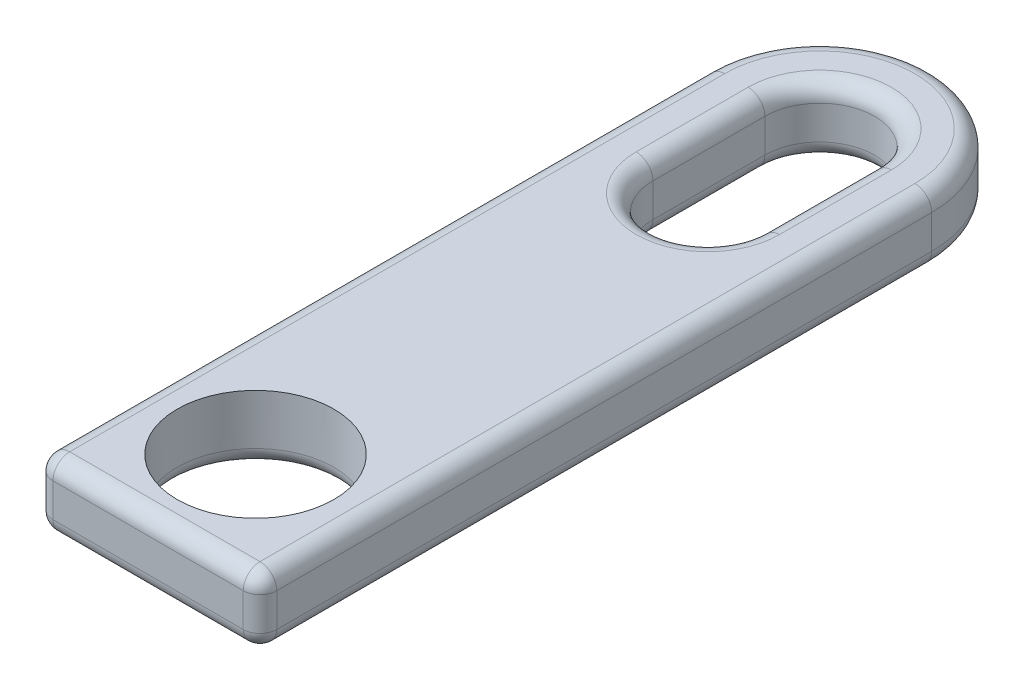
ISO-10303-21;
HEADER;
FILE_DESCRIPTION(('STEP AP214'),'2;1');
FILE_NAME('part.step','',(''),(''),'','','');
FILE_SCHEMA(('AUTOMOTIVE_DESIGN { 1 0 10303 214 1 1 1 1 }'));
ENDSEC;
DATA;
#1=APPLICATION_CONTEXT('core data for automotive mechanical design processes');
#2=APPLICATION_PROTOCOL_DEFINITION('international standard','automotive_design',2000,#1);
#3=PRODUCT_CONTEXT('',#1,'mechanical');
#4=PRODUCT('Part','Part','',(#3));
#5=PRODUCT_RELATED_PRODUCT_CATEGORY('part','',(#4));
#6=PRODUCT_DEFINITION_FORMATION('','',#4);
#7=PRODUCT_DEFINITION_CONTEXT('part definition',#1,'design');
#8=PRODUCT_DEFINITION('design','',#6,#7);
#9=PRODUCT_DEFINITION_SHAPE('','',#8);
#10=(LENGTH_UNIT() NAMED_UNIT(*) SI_UNIT(.MILLI.,.METRE.));
#11=(NAMED_UNIT(*) PLANE_ANGLE_UNIT() SI_UNIT($,.RADIAN.));
#12=(NAMED_UNIT(*) SI_UNIT($,.STERADIAN.) SOLID_ANGLE_UNIT());
#13=UNCERTAINTY_MEASURE_WITH_UNIT(LENGTH_MEASURE(1.E-05),#10,'distance_accuracy_value','');
#14=(GEOMETRIC_REPRESENTATION_CONTEXT(3) GLOBAL_UNCERTAINTY_ASSIGNED_CONTEXT((#13)) GLOBAL_UNIT_ASSIGNED_CONTEXT((#10,
#11,#12)) REPRESENTATION_CONTEXT('',''));
#15=CARTESIAN_POINT('',(0.,0.,0.));
#16=DIRECTION('',(0.,0.,1.));
#17=DIRECTION('',(1.,0.,0.));
#18=AXIS2_PLACEMENT_3D('',#15,#16,#17);
#19=CARTESIAN_POINT('',(0.,0.,7.44915748014848));
#20=DIRECTION('',(0.,-1.,0.));
#21=DIRECTION('',(0.,0.,-1.));
#22=AXIS2_PLACEMENT_3D('',#19,#20,#21);
#23=PLANE('',#22);
#24=DIRECTION('',(1.,0.,0.));
#25=VECTOR('',#24,1.);
#26=CARTESIAN_POINT('',(-5.,0.,36.6991574801485));
#27=LINE('',#26,#25);
#28=CARTESIAN_POINT('',(4.25,0.,36.6991574801485));
#29=VERTEX_POINT('',#28);
#30=CARTESIAN_POINT('',(1.28840987267252,0.,36.6991574801485));
#31=VERTEX_POINT('',#30);
#32=EDGE_CURVE('E56',#29,#31,#27,.F.);
#33=ORIENTED_EDGE('',*,*,#32,.T.);
#34=CARTESIAN_POINT('',(0.,0.,32.6491574801485));
#35=DIRECTION('',(0.,-1.,0.));
#36=DIRECTION('',(0.,0.,-1.));
#37=AXIS2_PLACEMENT_3D('',#34,#35,#36);
#38=CIRCLE('',#37,4.25);
#39=CARTESIAN_POINT('',(4.25,0.,32.6491574801485));
#40=VERTEX_POINT('',#39);
#41=EDGE_CURVE('E291',#31,#40,#38,.F.);
#42=ORIENTED_EDGE('',*,*,#41,.T.);
#43=DIRECTION('',(0.,0.,-1.));
#44=VECTOR('',#43,1.);
#45=CARTESIAN_POINT('',(4.25,0.,37.4491574801485));
#46=LINE('',#45,#44);
#47=EDGE_CURVE('E60',#40,#29,#46,.F.);
#48=ORIENTED_EDGE('',*,*,#47,.T.);
#49=EDGE_LOOP('',(#33,#42,#48));
#50=FACE_BOUND('',#49,.T.);
#51=ADVANCED_FACE('F39',(#50),#23,.T.);
#52=DIRECTION('',(0.,0.,1.));
#53=VECTOR('',#52,1.);
#54=CARTESIAN_POINT('',(-4.25,0.,7.44915748014848));
#55=LINE('',#54,#53);
#56=CARTESIAN_POINT('',(-4.25,0.,36.6991574801485));
#57=VERTEX_POINT('',#56);
#58=CARTESIAN_POINT('',(-4.25,0.,32.6491574801485));
#59=VERTEX_POINT('',#58);
#60=EDGE_CURVE('E271',#57,#59,#55,.F.);
#61=ORIENTED_EDGE('',*,*,#60,.T.);
#62=CARTESIAN_POINT('',(0.,0.,32.6491574801485));
#63=DIRECTION('',(0.,-1.,0.));
#64=DIRECTION('',(0.,0.,-1.));
#65=AXIS2_PLACEMENT_3D('',#62,#63,#64);
#66=CIRCLE('',#65,4.25);
#67=CARTESIAN_POINT('',(-1.28840987267252,0.,36.6991574801485));
#68=VERTEX_POINT('',#67);
#69=EDGE_CURVE('E278',#59,#68,#66,.F.);
#70=ORIENTED_EDGE('',*,*,#69,.T.);
#71=DIRECTION('',(1.,0.,0.));
#72=VECTOR('',#71,1.);
#73=CARTESIAN_POINT('',(-5.,0.,36.6991574801485));
#74=LINE('',#73,#72);
#75=EDGE_CURVE('E276',#68,#57,#74,.F.);
#76=ORIENTED_EDGE('',*,*,#75,.T.);
#77=EDGE_LOOP('',(#61,#70,#76));
#78=FACE_BOUND('',#77,.T.);
#79=ADVANCED_FACE('F394',(#78),#23,.T.);
#80=CARTESIAN_POINT('',(0.,3.,7.44915748014848));
#81=DIRECTION('',(0.,-1.,0.));
#82=DIRECTION('',(0.,0.,-1.));
#83=AXIS2_PLACEMENT_3D('',#80,#81,#82);
#84=PLANE('',#83);
#85=DIRECTION('',(0.,0.,1.));
#86=VECTOR('',#85,1.);
#87=CARTESIAN_POINT('',(-4.25,3.,7.44915748014848));
#88=LINE('',#87,#86);
#89=CARTESIAN_POINT('',(-4.25,3.,7.44915748014848));
#90=VERTEX_POINT('',#89);
#91=CARTESIAN_POINT('',(-4.25,3.,36.6991574801485));
#92=VERTEX_POINT('',#91);
#93=EDGE_CURVE('E232',#90,#92,#88,.T.);
#94=ORIENTED_EDGE('',*,*,#93,.T.);
#95=DIRECTION('',(1.,0.,0.));
#96=VECTOR('',#95,1.);
#97=CARTESIAN_POINT('',(0.,3.,36.6991574801485));
#98=LINE('',#97,#96);
#99=CARTESIAN_POINT('',(4.25,3.,36.6991574801485));
#100=VERTEX_POINT('',#99);
#101=EDGE_CURVE('E235',#92,#100,#98,.T.);
#102=ORIENTED_EDGE('',*,*,#101,.T.);
#103=DIRECTION('',(0.,0.,-1.));
#104=VECTOR('',#103,1.);
#105=CARTESIAN_POINT('',(4.25,3.,7.44915748014848));
#106=LINE('',#105,#104);
#107=CARTESIAN_POINT('',(4.25,3.,7.44915748014848));
#108=VERTEX_POINT('',#107);
#109=EDGE_CURVE('E230',#100,#108,#106,.T.);
#110=ORIENTED_EDGE('',*,*,#109,.T.);
#111=CARTESIAN_POINT('',(0.,3.,7.44915748014848));
#112=DIRECTION('',(0.,-1.,0.));
#113=DIRECTION('',(0.,0.,-1.));
#114=AXIS2_PLACEMENT_3D('',#111,#112,#113);
#115=CIRCLE('',#114,4.25);
#116=EDGE_CURVE('E228',#108,#90,#115,.F.);
#117=ORIENTED_EDGE('',*,*,#116,.T.);
#118=EDGE_LOOP('',(#94,#102,#110,#117));
#119=FACE_BOUND('',#118,.T.);
#120=DIRECTION('',(0.,0.,1.));
#121=VECTOR('',#120,1.);
#122=CARTESIAN_POINT('',(-3.20000000000001,3.,7.44915748014848));
#123=LINE('',#122,#121);
#124=CARTESIAN_POINT('',(-3.2,3.,12.4491574801485));
#125=VERTEX_POINT('',#124);
#126=CARTESIAN_POINT('',(-3.20000000000001,3.,7.44915748014848));
#127=VERTEX_POINT('',#126);
#128=EDGE_CURVE('E216',#125,#127,#123,.F.);
#129=ORIENTED_EDGE('',*,*,#128,.T.);
#130=CARTESIAN_POINT('',(0.,3.,7.44915748014848));
#131=DIRECTION('',(0.,-1.,0.));
#132=DIRECTION('',(0.,0.,-1.));
#133=AXIS2_PLACEMENT_3D('',#130,#131,#132);
#134=CIRCLE('',#133,3.2);
#135=CARTESIAN_POINT('',(3.2,3.,7.44915748014848));
#136=VERTEX_POINT('',#135);
#137=EDGE_CURVE('E226',#127,#136,#134,.T.);
#138=ORIENTED_EDGE('',*,*,#137,.T.);
#139=DIRECTION('',(0.,0.,-1.));
#140=VECTOR('',#139,1.);
#141=CARTESIAN_POINT('',(3.2,3.,12.4491574801485));
#142=LINE('',#141,#140);
#143=CARTESIAN_POINT('',(3.2,3.,12.4491574801485));
#144=VERTEX_POINT('',#143);
#145=EDGE_CURVE('E206',#136,#144,#142,.F.);
#146=ORIENTED_EDGE('',*,*,#145,.T.);
#147=CARTESIAN_POINT('',(0.,3.,12.4491574801485));
#148=DIRECTION('',(0.,-1.,0.));
#149=DIRECTION('',(0.,0.,-1.));
#150=AXIS2_PLACEMENT_3D('',#147,#148,#149);
#151=CIRCLE('',#150,3.2);
#152=EDGE_CURVE('E218',#144,#125,#151,.T.);
#153=ORIENTED_EDGE('',*,*,#152,.T.);
#154=EDGE_LOOP('',(#129,#138,#146,#153));
#155=FACE_BOUND('',#154,.T.);
#156=CARTESIAN_POINT('',(0.,3.,32.6491574801485));
#157=DIRECTION('',(0.,1.,0.));
#158=DIRECTION('',(0.,0.,1.));
#159=AXIS2_PLACEMENT_3D('',#156,#157,#158);
#160=CIRCLE('',#159,3.5);
#161=CARTESIAN_POINT('',(0.,3.,36.1491574801485));
#162=VERTEX_POINT('',#161);
#163=EDGE_CURVE('E201',#162,#162,#160,.T.);
#164=ORIENTED_EDGE('',*,*,#163,.F.);
#165=EDGE_LOOP('',(#164));
#166=FACE_BOUND('',#165,.T.);
#167=ADVANCED_FACE('F400',(#119,#155,#166),#84,.F.);
#168=DIRECTION('',(0.,0.,1.));
#169=VECTOR('',#168,1.);
#170=CARTESIAN_POINT('',(-3.20000000000001,0.,7.44915748014848));
#171=LINE('',#170,#169);
#172=CARTESIAN_POINT('',(-3.2,0.,7.44915748014848));
#173=VERTEX_POINT('',#172);
#174=CARTESIAN_POINT('',(-3.2,0.,12.4491574801485));
#175=VERTEX_POINT('',#174);
#176=EDGE_CURVE('E284',#173,#175,#171,.T.);
#177=ORIENTED_EDGE('',*,*,#176,.T.);
#178=CARTESIAN_POINT('',(0.,0.,12.4491574801485));
#179=DIRECTION('',(0.,-1.,0.));
#180=DIRECTION('',(0.,0.,-1.));
#181=AXIS2_PLACEMENT_3D('',#178,#179,#180);
#182=CIRCLE('',#181,3.2);
#183=CARTESIAN_POINT('',(3.2,0.,12.4491574801485));
#184=VERTEX_POINT('',#183);
#185=EDGE_CURVE('E286',#175,#184,#182,.F.);
#186=ORIENTED_EDGE('',*,*,#185,.T.);
#187=DIRECTION('',(0.,0.,-1.));
#188=VECTOR('',#187,1.);
#189=CARTESIAN_POINT('',(3.2,0.,7.44915748014848));
#190=LINE('',#189,#188);
#191=CARTESIAN_POINT('',(3.2,0.,7.44915748014848));
#192=VERTEX_POINT('',#191);
#193=EDGE_CURVE('E280',#184,#192,#190,.T.);
#194=ORIENTED_EDGE('',*,*,#193,.T.);
#195=CARTESIAN_POINT('',(0.,0.,7.44915748014848));
#196=DIRECTION('',(0.,-1.,0.));
#197=DIRECTION('',(0.,0.,-1.));
#198=AXIS2_PLACEMENT_3D('',#195,#196,#197);
#199=CIRCLE('',#198,3.2);
#200=EDGE_CURVE('E282',#192,#173,#199,.F.);
#201=ORIENTED_EDGE('',*,*,#200,.T.);
#202=EDGE_LOOP('',(#177,#186,#194,#201));
#203=FACE_BOUND('',#202,.T.);
#204=DIRECTION('',(0.,0.,-1.));
#205=VECTOR('',#204,1.);
#206=CARTESIAN_POINT('',(4.25,0.,37.4491574801485));
#207=LINE('',#206,#205);
#208=CARTESIAN_POINT('',(4.25,0.,7.44915748014848));
#209=VERTEX_POINT('',#208);
#210=EDGE_CURVE('E266',#209,#40,#207,.F.);
#211=ORIENTED_EDGE('',*,*,#210,.T.);
#212=CARTESIAN_POINT('',(0.,0.,32.6491574801485));
#213=DIRECTION('',(0.,-1.,0.));
#214=DIRECTION('',(0.,0.,-1.));
#215=AXIS2_PLACEMENT_3D('',#212,#213,#214);
#216=CIRCLE('',#215,4.25);
#217=EDGE_CURVE('E274',#40,#59,#216,.F.);
#218=ORIENTED_EDGE('',*,*,#217,.T.);
#219=DIRECTION('',(0.,0.,1.));
#220=VECTOR('',#219,1.);
#221=CARTESIAN_POINT('',(-4.25,0.,7.44915748014848));
#222=LINE('',#221,#220);
#223=CARTESIAN_POINT('',(-4.25,0.,7.44915748014848));
#224=VERTEX_POINT('',#223);
#225=EDGE_CURVE('E269',#59,#224,#222,.F.);
#226=ORIENTED_EDGE('',*,*,#225,.T.);
#227=CARTESIAN_POINT('',(0.,0.,7.44915748014848));
#228=DIRECTION('',(0.,-1.,0.));
#229=DIRECTION('',(0.,0.,-1.));
#230=AXIS2_PLACEMENT_3D('',#227,#228,#229);
#231=CIRCLE('',#230,4.25);
#232=EDGE_CURVE('E264',#224,#209,#231,.T.);
#233=ORIENTED_EDGE('',*,*,#232,.T.);
#234=EDGE_LOOP('',(#211,#218,#226,#233));
#235=FACE_BOUND('',#234,.T.);
#236=ADVANCED_FACE('F396',(#203,#235),#23,.T.);
#237=CARTESIAN_POINT('',(5.,3.,7.44915748014848));
#238=DIRECTION('',(-1.,0.,0.));
#239=DIRECTION('',(0.,0.,1.));
#240=AXIS2_PLACEMENT_3D('',#237,#238,#239);
#241=PLANE('',#240);
#242=DIRECTION('',(0.,-1.,0.));
#243=VECTOR('',#242,1.);
#244=CARTESIAN_POINT('',(5.,3.,7.44915748014848));
#245=LINE('',#244,#243);
#246=CARTESIAN_POINT('',(5.,2.25,7.44915748014848));
#247=VERTEX_POINT('',#246);
#248=CARTESIAN_POINT('',(5.,0.75,7.44915748014848));
#249=VERTEX_POINT('',#248);
#250=EDGE_CURVE('E220',#247,#249,#245,.T.);
#251=ORIENTED_EDGE('',*,*,#250,.F.);
#252=DIRECTION('',(0.,0.,-1.));
#253=VECTOR('',#252,1.);
#254=CARTESIAN_POINT('',(5.,2.25,7.44915748014848));
#255=LINE('',#254,#253);
#256=CARTESIAN_POINT('',(5.,2.25,36.6991574801485));
#257=VERTEX_POINT('',#256);
#258=EDGE_CURVE('E253',#247,#257,#255,.F.);
#259=ORIENTED_EDGE('',*,*,#258,.T.);
#260=DIRECTION('',(0.,-1.,0.));
#261=VECTOR('',#260,1.);
#262=CARTESIAN_POINT('',(5.,3.,36.6991574801485));
#263=LINE('',#262,#261);
#264=CARTESIAN_POINT('',(5.,0.75,36.6991574801485));
#265=VERTEX_POINT('',#264);
#266=EDGE_CURVE('E251',#257,#265,#263,.T.);
#267=ORIENTED_EDGE('',*,*,#266,.T.);
#268=DIRECTION('',(0.,0.,-1.));
#269=VECTOR('',#268,1.);
#270=CARTESIAN_POINT('',(5.,0.75,7.44915748014848));
#271=LINE('',#270,#269);
#272=EDGE_CURVE('E249',#265,#249,#271,.T.);
#273=ORIENTED_EDGE('',*,*,#272,.T.);
#274=EDGE_LOOP('',(#251,#259,#267,#273));
#275=FACE_BOUND('',#274,.T.);
#276=ADVANCED_FACE('F405',(#275),#241,.F.);
#277=CARTESIAN_POINT('',(0.,3.,7.44915748014848));
#278=DIRECTION('',(0.,-1.,0.));
#279=DIRECTION('',(0.,0.,-1.));
#280=AXIS2_PLACEMENT_3D('',#277,#278,#279);
#281=CYLINDRICAL_SURFACE('',#280,5.);
#282=DIRECTION('',(0.,-1.,0.));
#283=VECTOR('',#282,1.);
#284=CARTESIAN_POINT('',(-5.,3.,7.44915748014848));
#285=LINE('',#284,#283);
#286=CARTESIAN_POINT('',(-5.,2.25,7.44915748014848));
#287=VERTEX_POINT('',#286);
#288=CARTESIAN_POINT('',(-5.,0.75,7.44915748014848));
#289=VERTEX_POINT('',#288);
#290=EDGE_CURVE('E472',#287,#289,#285,.T.);
#291=ORIENTED_EDGE('',*,*,#290,.F.);
#292=CARTESIAN_POINT('',(0.,2.25,7.44915748014848));
#293=DIRECTION('',(0.,-1.,0.));
#294=DIRECTION('',(0.,0.,-1.));
#295=AXIS2_PLACEMENT_3D('',#292,#293,#294);
#296=CIRCLE('',#295,5.);
#297=EDGE_CURVE('E11',#287,#247,#296,.T.);
#298=ORIENTED_EDGE('',*,*,#297,.T.);
#299=ORIENTED_EDGE('',*,*,#250,.T.);
#300=CARTESIAN_POINT('',(0.,0.75,7.44915748014848));
#301=DIRECTION('',(0.,-1.,0.));
#302=DIRECTION('',(0.,0.,-1.));
#303=AXIS2_PLACEMENT_3D('',#300,#301,#302);
#304=CIRCLE('',#303,5.);
#305=EDGE_CURVE('E48',#249,#289,#304,.F.);
#306=ORIENTED_EDGE('',*,*,#305,.T.);
#307=EDGE_LOOP('',(#291,#298,#299,#306));
#308=FACE_BOUND('',#307,.T.);
#309=ADVANCED_FACE('F411',(#308),#281,.T.);
#310=CARTESIAN_POINT('',(-5.,3.,7.44915748014848));
#311=DIRECTION('',(1.,0.,0.));
#312=DIRECTION('',(0.,0.,-1.));
#313=AXIS2_PLACEMENT_3D('',#310,#311,#312);
#314=PLANE('',#313);
#315=DIRECTION('',(0.,-1.,0.));
#316=VECTOR('',#315,1.);
#317=CARTESIAN_POINT('',(-5.,3.,36.6991574801485));
#318=LINE('',#317,#316);
#319=CARTESIAN_POINT('',(-5.,0.75,36.6991574801485));
#320=VERTEX_POINT('',#319);
#321=CARTESIAN_POINT('',(-5.,2.25,36.6991574801485));
#322=VERTEX_POINT('',#321);
#323=EDGE_CURVE('E244',#320,#322,#318,.F.);
#324=ORIENTED_EDGE('',*,*,#323,.T.);
#325=DIRECTION('',(0.,0.,1.));
#326=VECTOR('',#325,1.);
#327=CARTESIAN_POINT('',(-5.,2.25,7.44915748014848));
#328=LINE('',#327,#326);
#329=EDGE_CURVE('E246',#322,#287,#328,.F.);
#330=ORIENTED_EDGE('',*,*,#329,.T.);
#331=ORIENTED_EDGE('',*,*,#290,.T.);
#332=DIRECTION('',(0.,0.,1.));
#333=VECTOR('',#332,1.);
#334=CARTESIAN_POINT('',(-5.,0.75,37.4491574801485));
#335=LINE('',#334,#333);
#336=EDGE_CURVE('E242',#289,#320,#335,.T.);
#337=ORIENTED_EDGE('',*,*,#336,.T.);
#338=EDGE_LOOP('',(#324,#330,#331,#337));
#339=FACE_BOUND('',#338,.T.);
#340=ADVANCED_FACE('F509',(#339),#314,.F.);
#341=CARTESIAN_POINT('',(-5.,3.,37.4491574801485));
#342=DIRECTION('',(0.,0.,-1.));
#343=DIRECTION('',(-1.,0.,0.));
#344=AXIS2_PLACEMENT_3D('',#341,#342,#343);
#345=PLANE('',#344);
#346=DIRECTION('',(1.,0.,0.));
#347=VECTOR('',#346,1.);
#348=CARTESIAN_POINT('',(-5.,2.25,37.4491574801485));
#349=LINE('',#348,#347);
#350=CARTESIAN_POINT('',(4.25,2.25,37.4491574801485));
#351=VERTEX_POINT('',#350);
#352=CARTESIAN_POINT('',(-4.25,2.25,37.4491574801485));
#353=VERTEX_POINT('',#352);
#354=EDGE_CURVE('E259',#351,#353,#349,.F.);
#355=ORIENTED_EDGE('',*,*,#354,.T.);
#356=DIRECTION('',(0.,-1.,0.));
#357=VECTOR('',#356,1.);
#358=CARTESIAN_POINT('',(-4.25,3.,37.4491574801485));
#359=LINE('',#358,#357);
#360=CARTESIAN_POINT('',(-4.25,0.75,37.4491574801485));
#361=VERTEX_POINT('',#360);
#362=EDGE_CURVE('E261',#353,#361,#359,.T.);
#363=ORIENTED_EDGE('',*,*,#362,.T.);
#364=DIRECTION('',(1.,0.,0.));
#365=VECTOR('',#364,1.);
#366=CARTESIAN_POINT('',(5.,0.75,37.4491574801485));
#367=LINE('',#366,#365);
#368=CARTESIAN_POINT('',(4.25,0.75,37.4491574801485));
#369=VERTEX_POINT('',#368);
#370=EDGE_CURVE('E255',#361,#369,#367,.T.);
#371=ORIENTED_EDGE('',*,*,#370,.T.);
#372=DIRECTION('',(0.,-1.,0.));
#373=VECTOR('',#372,1.);
#374=CARTESIAN_POINT('',(4.25,3.,37.4491574801485));
#375=LINE('',#374,#373);
#376=EDGE_CURVE('E257',#369,#351,#375,.F.);
#377=ORIENTED_EDGE('',*,*,#376,.T.);
#378=EDGE_LOOP('',(#355,#363,#371,#377));
#379=FACE_BOUND('',#378,.T.);
#380=ADVANCED_FACE('F502',(#379),#345,.F.);
#381=CARTESIAN_POINT('',(0.,3.,7.44915748014848));
#382=DIRECTION('',(0.,-1.,0.));
#383=DIRECTION('',(0.,0.,-1.));
#384=AXIS2_PLACEMENT_3D('',#381,#382,#383);
#385=CYLINDRICAL_SURFACE('',#384,2.45);
#386=DIRECTION('',(0.,-1.,0.));
#387=VECTOR('',#386,1.);
#388=CARTESIAN_POINT('',(2.45,3.,7.44915748014848));
#389=LINE('',#388,#387);
#390=CARTESIAN_POINT('',(2.45,2.25,7.44915748014848));
#391=VERTEX_POINT('',#390);
#392=CARTESIAN_POINT('',(2.45,0.75,7.44915748014848));
#393=VERTEX_POINT('',#392);
#394=EDGE_CURVE('E181',#391,#393,#389,.T.);
#395=ORIENTED_EDGE('',*,*,#394,.F.);
#396=CARTESIAN_POINT('',(0.,2.25,7.44915748014848));
#397=DIRECTION('',(0.,-1.,0.));
#398=DIRECTION('',(0.,0.,-1.));
#399=AXIS2_PLACEMENT_3D('',#396,#397,#398);
#400=CIRCLE('',#399,2.45);
#401=CARTESIAN_POINT('',(-2.45000000000001,2.25,7.44915748014848));
#402=VERTEX_POINT('',#401);
#403=EDGE_CURVE('E197',#391,#402,#400,.F.);
#404=ORIENTED_EDGE('',*,*,#403,.T.);
#405=DIRECTION('',(0.,-1.,0.));
#406=VECTOR('',#405,1.);
#407=CARTESIAN_POINT('',(-2.45000000000001,3.,7.44915748014848));
#408=LINE('',#407,#406);
#409=CARTESIAN_POINT('',(-2.45000000000001,0.75,7.44915748014848));
#410=VERTEX_POINT('',#409);
#411=EDGE_CURVE('E467',#402,#410,#408,.T.);
#412=ORIENTED_EDGE('',*,*,#411,.T.);
#413=CARTESIAN_POINT('',(0.,0.75,7.44915748014848));
#414=DIRECTION('',(0.,-1.,0.));
#415=DIRECTION('',(0.,0.,-1.));
#416=AXIS2_PLACEMENT_3D('',#413,#414,#415);
#417=CIRCLE('',#416,2.45);
#418=EDGE_CURVE('E200',#410,#393,#417,.T.);
#419=ORIENTED_EDGE('',*,*,#418,.T.);
#420=EDGE_LOOP('',(#395,#404,#412,#419));
#421=FACE_BOUND('',#420,.T.);
#422=ADVANCED_FACE('F194',(#421),#385,.F.);
#423=CARTESIAN_POINT('',(-2.45000000000001,3.,7.44915748014848));
#424=DIRECTION('',(1.,0.,0.));
#425=DIRECTION('',(0.,0.,-1.));
#426=AXIS2_PLACEMENT_3D('',#423,#424,#425);
#427=PLANE('',#426);
#428=DIRECTION('',(0.,-1.,0.));
#429=VECTOR('',#428,1.);
#430=CARTESIAN_POINT('',(-2.45,3.,12.4491574801485));
#431=LINE('',#430,#429);
#432=CARTESIAN_POINT('',(-2.45,2.25,12.4491574801485));
#433=VERTEX_POINT('',#432);
#434=CARTESIAN_POINT('',(-2.45,0.75,12.4491574801485));
#435=VERTEX_POINT('',#434);
#436=EDGE_CURVE('E464',#433,#435,#431,.T.);
#437=ORIENTED_EDGE('',*,*,#436,.T.);
#438=DIRECTION('',(0.,0.,1.));
#439=VECTOR('',#438,1.);
#440=CARTESIAN_POINT('',(-2.45000000000001,0.75,7.44915748014848));
#441=LINE('',#440,#439);
#442=EDGE_CURVE('E298',#435,#410,#441,.F.);
#443=ORIENTED_EDGE('',*,*,#442,.T.);
#444=ORIENTED_EDGE('',*,*,#411,.F.);
#445=DIRECTION('',(0.,0.,1.));
#446=VECTOR('',#445,1.);
#447=CARTESIAN_POINT('',(-2.45,2.25,12.4491574801485));
#448=LINE('',#447,#446);
#449=EDGE_CURVE('E296',#402,#433,#448,.T.);
#450=ORIENTED_EDGE('',*,*,#449,.T.);
#451=EDGE_LOOP('',(#437,#443,#444,#450));
#452=FACE_BOUND('',#451,.T.);
#453=ADVANCED_FACE('F630',(#452),#427,.T.);
#454=CARTESIAN_POINT('',(0.,3.,12.4491574801485));
#455=DIRECTION('',(0.,-1.,0.));
#456=DIRECTION('',(0.,0.,-1.));
#457=AXIS2_PLACEMENT_3D('',#454,#455,#456);
#458=CYLINDRICAL_SURFACE('',#457,2.45);
#459=ORIENTED_EDGE('',*,*,#436,.F.);
#460=CARTESIAN_POINT('',(0.,2.25,12.4491574801485));
#461=DIRECTION('',(0.,-1.,0.));
#462=DIRECTION('',(0.,0.,-1.));
#463=AXIS2_PLACEMENT_3D('',#460,#461,#462);
#464=CIRCLE('',#463,2.45);
#465=CARTESIAN_POINT('',(2.45,2.25,12.4491574801485));
#466=VERTEX_POINT('',#465);
#467=EDGE_CURVE('E240',#433,#466,#464,.F.);
#468=ORIENTED_EDGE('',*,*,#467,.T.);
#469=DIRECTION('',(0.,-1.,0.));
#470=VECTOR('',#469,1.);
#471=CARTESIAN_POINT('',(2.45,3.,12.4491574801485));
#472=LINE('',#471,#470);
#473=CARTESIAN_POINT('',(2.45,0.75,12.4491574801485));
#474=VERTEX_POINT('',#473);
#475=EDGE_CURVE('E184',#466,#474,#472,.T.);
#476=ORIENTED_EDGE('',*,*,#475,.T.);
#477=CARTESIAN_POINT('',(0.,0.75,12.4491574801485));
#478=DIRECTION('',(0.,-1.,0.));
#479=DIRECTION('',(0.,0.,-1.));
#480=AXIS2_PLACEMENT_3D('',#477,#478,#479);
#481=CIRCLE('',#480,2.45);
#482=EDGE_CURVE('E189',#474,#435,#481,.T.);
#483=ORIENTED_EDGE('',*,*,#482,.T.);
#484=EDGE_LOOP('',(#459,#468,#476,#483));
#485=FACE_BOUND('',#484,.T.);
#486=ADVANCED_FACE('F461',(#485),#458,.F.);
#487=CARTESIAN_POINT('',(2.45,3.,7.44915748014848));
#488=DIRECTION('',(-1.,0.,0.));
#489=DIRECTION('',(0.,0.,1.));
#490=AXIS2_PLACEMENT_3D('',#487,#488,#489);
#491=PLANE('',#490);
#492=ORIENTED_EDGE('',*,*,#475,.F.);
#493=DIRECTION('',(0.,0.,-1.));
#494=VECTOR('',#493,1.);
#495=CARTESIAN_POINT('',(2.45,2.25,7.44915748014848));
#496=LINE('',#495,#494);
#497=EDGE_CURVE('E178',#466,#391,#496,.T.);
#498=ORIENTED_EDGE('',*,*,#497,.T.);
#499=ORIENTED_EDGE('',*,*,#394,.T.);
#500=DIRECTION('',(0.,0.,-1.));
#501=VECTOR('',#500,1.);
#502=CARTESIAN_POINT('',(2.45,0.75,7.44915748014848));
#503=LINE('',#502,#501);
#504=EDGE_CURVE('E190',#393,#474,#503,.F.);
#505=ORIENTED_EDGE('',*,*,#504,.T.);
#506=EDGE_LOOP('',(#492,#498,#499,#505));
#507=FACE_BOUND('',#506,.T.);
#508=ADVANCED_FACE('F180',(#507),#491,.T.);
#509=CARTESIAN_POINT('',(0.,3.,32.6491574801485));
#510=DIRECTION('',(0.,-1.,0.));
#511=DIRECTION('',(0.,0.,-1.));
#512=AXIS2_PLACEMENT_3D('',#509,#510,#511);
#513=CYLINDRICAL_SURFACE('',#512,3.5);
#514=CARTESIAN_POINT('',(0.,0.75,32.6491574801485));
#515=DIRECTION('',(0.,-1.,0.));
#516=DIRECTION('',(0.,0.,-1.));
#517=AXIS2_PLACEMENT_3D('',#514,#515,#516);
#518=CIRCLE('',#517,3.5);
#519=CARTESIAN_POINT('',(0.,0.75,29.1491574801485));
#520=VERTEX_POINT('',#519);
#521=EDGE_CURVE('E293',#520,#520,#518,.T.);
#522=ORIENTED_EDGE('',*,*,#521,.T.);
#523=EDGE_LOOP('',(#522));
#524=FACE_BOUND('',#523,.T.);
#525=ORIENTED_EDGE('',*,*,#163,.T.);
#526=EDGE_LOOP('',(#525));
#527=FACE_BOUND('',#526,.T.);
#528=ADVANCED_FACE('F613',(#524,#527),#513,.F.);
#529=CARTESIAN_POINT('',(0.,2.25,12.4491574801485));
#530=DIRECTION('',(0.,-1.,0.));
#531=DIRECTION('',(0.,0.,-1.));
#532=AXIS2_PLACEMENT_3D('',#529,#530,#531);
#533=TOROIDAL_SURFACE('',#532,3.2,0.75);
#534=CARTESIAN_POINT('',(-3.2,2.25,12.4491574801485));
#535=DIRECTION('',(0.,0.,-1.));
#536=DIRECTION('',(-1.,0.,0.));
#537=AXIS2_PLACEMENT_3D('',#534,#535,#536);
#538=CIRCLE('',#537,0.75);
#539=EDGE_CURVE('E210',#125,#433,#538,.T.);
#540=ORIENTED_EDGE('',*,*,#539,.F.);
#541=ORIENTED_EDGE('',*,*,#152,.F.);
#542=CARTESIAN_POINT('',(3.2,2.25,12.4491574801485));
#543=DIRECTION('',(0.,0.,-1.));
#544=DIRECTION('',(-1.,0.,0.));
#545=AXIS2_PLACEMENT_3D('',#542,#543,#544);
#546=CIRCLE('',#545,0.75);
#547=EDGE_CURVE('E305',#466,#144,#546,.T.);
#548=ORIENTED_EDGE('',*,*,#547,.F.);
#549=ORIENTED_EDGE('',*,*,#467,.F.);
#550=EDGE_LOOP('',(#540,#541,#548,#549));
#551=FACE_BOUND('',#550,.T.);
#552=ADVANCED_FACE('F610',(#551),#533,.T.);
#553=CARTESIAN_POINT('',(3.2,2.25,7.44915748014848));
#554=DIRECTION('',(0.,0.,1.));
#555=DIRECTION('',(1.,0.,0.));
#556=AXIS2_PLACEMENT_3D('',#553,#554,#555);
#557=CYLINDRICAL_SURFACE('',#556,0.75);
#558=ORIENTED_EDGE('',*,*,#547,.T.);
#559=ORIENTED_EDGE('',*,*,#145,.F.);
#560=CARTESIAN_POINT('',(3.2,2.25,7.44915748014848));
#561=DIRECTION('',(0.,0.,-1.));
#562=DIRECTION('',(-1.,0.,0.));
#563=AXIS2_PLACEMENT_3D('',#560,#561,#562);
#564=CIRCLE('',#563,0.75);
#565=EDGE_CURVE('E204',#391,#136,#564,.T.);
#566=ORIENTED_EDGE('',*,*,#565,.F.);
#567=ORIENTED_EDGE('',*,*,#497,.F.);
#568=EDGE_LOOP('',(#558,#559,#566,#567));
#569=FACE_BOUND('',#568,.T.);
#570=ADVANCED_FACE('F205',(#569),#557,.T.);
#571=CARTESIAN_POINT('',(-3.20000000000001,2.25,7.44915748014848));
#572=DIRECTION('',(0.,0.,-1.));
#573=DIRECTION('',(-1.,0.,0.));
#574=AXIS2_PLACEMENT_3D('',#571,#572,#573);
#575=CYLINDRICAL_SURFACE('',#574,0.75);
#576=ORIENTED_EDGE('',*,*,#539,.T.);
#577=ORIENTED_EDGE('',*,*,#449,.F.);
#578=CARTESIAN_POINT('',(-3.20000000000001,2.25,7.44915748014848));
#579=DIRECTION('',(0.,0.,-1.));
#580=DIRECTION('',(-1.,0.,0.));
#581=AXIS2_PLACEMENT_3D('',#578,#579,#580);
#582=CIRCLE('',#581,0.75);
#583=EDGE_CURVE('E211',#127,#402,#582,.T.);
#584=ORIENTED_EDGE('',*,*,#583,.F.);
#585=ORIENTED_EDGE('',*,*,#128,.F.);
#586=EDGE_LOOP('',(#576,#577,#584,#585));
#587=FACE_BOUND('',#586,.T.);
#588=ADVANCED_FACE('F617',(#587),#575,.T.);
#589=CARTESIAN_POINT('',(0.,2.25,7.44915748014848));
#590=DIRECTION('',(0.,-1.,0.));
#591=DIRECTION('',(0.,0.,-1.));
#592=AXIS2_PLACEMENT_3D('',#589,#590,#591);
#593=TOROIDAL_SURFACE('',#592,3.2,0.75);
#594=ORIENTED_EDGE('',*,*,#565,.T.);
#595=ORIENTED_EDGE('',*,*,#137,.F.);
#596=ORIENTED_EDGE('',*,*,#583,.T.);
#597=ORIENTED_EDGE('',*,*,#403,.F.);
#598=EDGE_LOOP('',(#594,#595,#596,#597));
#599=FACE_BOUND('',#598,.T.);
#600=ADVANCED_FACE('F213',(#599),#593,.T.);
#601=CARTESIAN_POINT('',(4.25,0.75,7.44915748014848));
#602=DIRECTION('',(0.,0.,1.));
#603=DIRECTION('',(1.,0.,0.));
#604=AXIS2_PLACEMENT_3D('',#601,#602,#603);
#605=CYLINDRICAL_SURFACE('',#604,0.75);
#606=CARTESIAN_POINT('',(4.25,0.75,36.6991574801485));
#607=DIRECTION('',(0.,0.,1.));
#608=DIRECTION('',(1.,0.,0.));
#609=AXIS2_PLACEMENT_3D('',#606,#607,#608);
#610=CIRCLE('',#609,0.75);
#611=EDGE_CURVE('E301',#29,#265,#610,.T.);
#612=ORIENTED_EDGE('',*,*,#611,.F.);
#613=ORIENTED_EDGE('',*,*,#47,.F.);
#614=ORIENTED_EDGE('',*,*,#210,.F.);
#615=CARTESIAN_POINT('',(4.25,0.75,7.44915748014848));
#616=DIRECTION('',(0.,0.,-1.));
#617=DIRECTION('',(-1.,0.,0.));
#618=AXIS2_PLACEMENT_3D('',#615,#616,#617);
#619=CIRCLE('',#618,0.75);
#620=EDGE_CURVE('E427',#249,#209,#619,.T.);
#621=ORIENTED_EDGE('',*,*,#620,.F.);
#622=ORIENTED_EDGE('',*,*,#272,.F.);
#623=EDGE_LOOP('',(#612,#613,#614,#621,#622));
#624=FACE_BOUND('',#623,.T.);
#625=ADVANCED_FACE('F372',(#624),#605,.T.);
#626=CARTESIAN_POINT('',(4.25,0.75,36.6991574801485));
#627=DIRECTION('',(1.,0.,0.));
#628=DIRECTION('',(0.,1.,0.));
#629=AXIS2_PLACEMENT_3D('',#626,#627,#628);
#630=SPHERICAL_SURFACE('',#629,0.75);
#631=CARTESIAN_POINT('',(4.25,0.75,36.6991574801485));
#632=DIRECTION('',(1.,0.,0.));
#633=DIRECTION('',(0.,0.,-1.));
#634=AXIS2_PLACEMENT_3D('',#631,#632,#633);
#635=CIRCLE('',#634,0.75);
#636=EDGE_CURVE('E349',#29,#369,#635,.F.);
#637=ORIENTED_EDGE('',*,*,#636,.F.);
#638=ORIENTED_EDGE('',*,*,#611,.T.);
#639=CARTESIAN_POINT('',(4.25,0.75,36.6991574801485));
#640=DIRECTION('',(0.,-1.,0.));
#641=DIRECTION('',(0.,0.,-1.));
#642=AXIS2_PLACEMENT_3D('',#639,#640,#641);
#643=CIRCLE('',#642,0.75);
#644=EDGE_CURVE('E430',#369,#265,#643,.F.);
#645=ORIENTED_EDGE('',*,*,#644,.F.);
#646=EDGE_LOOP('',(#637,#638,#645));
#647=FACE_BOUND('',#646,.T.);
#648=ADVANCED_FACE('F369',(#647),#630,.T.);
#649=CARTESIAN_POINT('',(0.,0.75,32.6491574801485));
#650=DIRECTION('',(0.,-1.,0.));
#651=DIRECTION('',(0.,0.,-1.));
#652=AXIS2_PLACEMENT_3D('',#649,#650,#651);
#653=TOROIDAL_SURFACE('',#652,4.25,0.75);
#654=ORIENTED_EDGE('',*,*,#521,.F.);
#655=EDGE_LOOP('',(#654));
#656=FACE_BOUND('',#655,.T.);
#657=ORIENTED_EDGE('',*,*,#217,.F.);
#658=ORIENTED_EDGE('',*,*,#41,.F.);
#659=CARTESIAN_POINT('',(1.28840987267252,0.,36.6991574801485));
#660=CARTESIAN_POINT('',(1.2851331860213,1.00870181655786E-08,36.6996661221591));
#661=CARTESIAN_POINT('',(1.28185619313419,5.2699888398753E-07,36.700172869667));
#662=CARTESIAN_POINT('',(1.15443382448486,3.99422589186592E-05,36.7198016722456));
#663=CARTESIAN_POINT('',(1.02985296822838,0.000791278450919136,36.7362053847098));
#664=CARTESIAN_POINT('',(0.780067611183362,0.00263528900622167,36.7634405249049));
#665=CARTESIAN_POINT('',(0.654862977666872,0.00372803936084402,36.7742707106689));
#666=CARTESIAN_POINT('',(0.404012282518739,0.00551104181942034,36.7902726588291));
#667=CARTESIAN_POINT('',(0.278366007307964,0.00620106055688764,36.7954411420184));
#668=CARTESIAN_POINT('',(0.0269854364939702,0.00681693504025167,36.8000654009684));
#669=CARTESIAN_POINT('',(-0.0987488457375011,0.0067428888834818,36.7995219100822));
#670=CARTESIAN_POINT('',(-0.400923662838513,0.00566518920325648,36.7913504342509));
#671=CARTESIAN_POINT('',(-0.577292408580851,0.00429745806324707,36.7809444225009));
#672=CARTESIAN_POINT('',(-0.928923923301029,0.00149236214877965,36.7490365731677));
#673=CARTESIAN_POINT('',(-1.10418732763872,5.50424818537382E-05,36.7275418383405));
#674=CARTESIAN_POINT('',(-1.28185619732515,5.35311494480973E-07,36.7001728702439));
#675=CARTESIAN_POINT('',(-1.28513319019801,1.85863839333045E-08,36.6996661227579));
#676=CARTESIAN_POINT('',(-1.28840987267252,0.,36.6991574801485));
#677=B_SPLINE_CURVE_WITH_KNOTS('',3,(#659,#660,#661,#662,#663,#664,#665,#666,#667,#668,#669,
#670,#671,#672,#673,#674,#675,#676),.UNSPECIFIED.,.F.,.F.,(4,2,2,2,2,2,2,2,4),(0.,
0.00994782526493634,0.38677471650457,0.763685540985928,1.14081455358104,1.51789514765775,
2.04757720117527,2.57692039334917,2.58686821861446),.UNSPECIFIED.);
#678=EDGE_CURVE('E340',#68,#31,#677,.F.);
#679=ORIENTED_EDGE('',*,*,#678,.F.);
#680=ORIENTED_EDGE('',*,*,#69,.F.);
#681=EDGE_LOOP('',(#657,#658,#679,#680));
#682=FACE_BOUND('',#681,.T.);
#683=ADVANCED_FACE('F351',(#656,#682),#653,.T.);
#684=CARTESIAN_POINT('',(0.,0.75,7.44915748014848));
#685=DIRECTION('',(0.,-1.,0.));
#686=DIRECTION('',(0.,0.,-1.));
#687=AXIS2_PLACEMENT_3D('',#684,#685,#686);
#688=TOROIDAL_SURFACE('',#687,4.25,0.75);
#689=ORIENTED_EDGE('',*,*,#620,.T.);
#690=ORIENTED_EDGE('',*,*,#232,.F.);
#691=CARTESIAN_POINT('',(-4.25,0.75,7.44915748014848));
#692=DIRECTION('',(0.,0.,1.));
#693=DIRECTION('',(1.,0.,0.));
#694=AXIS2_PLACEMENT_3D('',#691,#692,#693);
#695=CIRCLE('',#694,0.75);
#696=EDGE_CURVE('E337',#289,#224,#695,.T.);
#697=ORIENTED_EDGE('',*,*,#696,.F.);
#698=ORIENTED_EDGE('',*,*,#305,.F.);
#699=EDGE_LOOP('',(#689,#690,#697,#698));
#700=FACE_BOUND('',#699,.T.);
#701=ADVANCED_FACE('F364',(#700),#688,.T.);
#702=CARTESIAN_POINT('',(4.25,3.,36.6991574801485));
#703=DIRECTION('',(0.,-1.,0.));
#704=DIRECTION('',(0.,0.,-1.));
#705=AXIS2_PLACEMENT_3D('',#702,#703,#704);
#706=CYLINDRICAL_SURFACE('',#705,0.75);
#707=ORIENTED_EDGE('',*,*,#644,.T.);
#708=ORIENTED_EDGE('',*,*,#266,.F.);
#709=CARTESIAN_POINT('',(4.25,2.25,36.6991574801485));
#710=DIRECTION('',(0.,1.,0.));
#711=DIRECTION('',(0.,0.,1.));
#712=AXIS2_PLACEMENT_3D('',#709,#710,#711);
#713=CIRCLE('',#712,0.75);
#714=EDGE_CURVE('E334',#351,#257,#713,.T.);
#715=ORIENTED_EDGE('',*,*,#714,.F.);
#716=ORIENTED_EDGE('',*,*,#376,.F.);
#717=EDGE_LOOP('',(#707,#708,#715,#716));
#718=FACE_BOUND('',#717,.T.);
#719=ADVANCED_FACE('F360',(#718),#706,.T.);
#720=CARTESIAN_POINT('',(-5.,0.75,36.6991574801485));
#721=DIRECTION('',(-1.,0.,0.));
#722=DIRECTION('',(0.,0.,1.));
#723=AXIS2_PLACEMENT_3D('',#720,#721,#722);
#724=CYLINDRICAL_SURFACE('',#723,0.75);
#725=ORIENTED_EDGE('',*,*,#636,.T.);
#726=ORIENTED_EDGE('',*,*,#370,.F.);
#727=CARTESIAN_POINT('',(-4.25,0.75,36.6991574801485));
#728=DIRECTION('',(-1.,0.,0.));
#729=DIRECTION('',(0.,0.,1.));
#730=AXIS2_PLACEMENT_3D('',#727,#728,#729);
#731=CIRCLE('',#730,0.75);
#732=EDGE_CURVE('E331',#57,#361,#731,.T.);
#733=ORIENTED_EDGE('',*,*,#732,.F.);
#734=ORIENTED_EDGE('',*,*,#75,.F.);
#735=ORIENTED_EDGE('',*,*,#678,.T.);
#736=ORIENTED_EDGE('',*,*,#32,.F.);
#737=EDGE_LOOP('',(#725,#726,#733,#734,#735,#736));
#738=FACE_BOUND('',#737,.T.);
#739=ADVANCED_FACE('F356',(#738),#724,.T.);
#740=CARTESIAN_POINT('',(-4.25,0.75,7.44915748014848));
#741=DIRECTION('',(0.,0.,-1.));
#742=DIRECTION('',(-1.,0.,0.));
#743=AXIS2_PLACEMENT_3D('',#740,#741,#742);
#744=CYLINDRICAL_SURFACE('',#743,0.75);
#745=ORIENTED_EDGE('',*,*,#225,.F.);
#746=ORIENTED_EDGE('',*,*,#60,.F.);
#747=CARTESIAN_POINT('',(-4.25,0.75,36.6991574801485));
#748=DIRECTION('',(0.,0.,1.));
#749=DIRECTION('',(1.,0.,0.));
#750=AXIS2_PLACEMENT_3D('',#747,#748,#749);
#751=CIRCLE('',#750,0.75);
#752=EDGE_CURVE('E328',#320,#57,#751,.T.);
#753=ORIENTED_EDGE('',*,*,#752,.F.);
#754=ORIENTED_EDGE('',*,*,#336,.F.);
#755=ORIENTED_EDGE('',*,*,#696,.T.);
#756=EDGE_LOOP('',(#745,#746,#753,#754,#755));
#757=FACE_BOUND('',#756,.T.);
#758=ADVANCED_FACE('F359',(#757),#744,.T.);
#759=CARTESIAN_POINT('',(4.25,2.25,36.6991574801485));
#760=DIRECTION('',(1.,0.,0.));
#761=DIRECTION('',(0.,0.,-1.));
#762=AXIS2_PLACEMENT_3D('',#759,#760,#761);
#763=SPHERICAL_SURFACE('',#762,0.75);
#764=CARTESIAN_POINT('',(4.25,2.25,36.6991574801485));
#765=DIRECTION('',(1.,0.,0.));
#766=DIRECTION('',(0.,0.,-1.));
#767=AXIS2_PLACEMENT_3D('',#764,#765,#766);
#768=CIRCLE('',#767,0.75);
#769=EDGE_CURVE('E322',#351,#100,#768,.F.);
#770=ORIENTED_EDGE('',*,*,#769,.F.);
#771=ORIENTED_EDGE('',*,*,#714,.T.);
#772=CARTESIAN_POINT('',(4.25,2.25,36.6991574801485));
#773=DIRECTION('',(0.,0.,1.));
#774=DIRECTION('',(1.,0.,0.));
#775=AXIS2_PLACEMENT_3D('',#772,#773,#774);
#776=CIRCLE('',#775,0.75);
#777=EDGE_CURVE('E325',#100,#257,#776,.F.);
#778=ORIENTED_EDGE('',*,*,#777,.F.);
#779=EDGE_LOOP('',(#770,#771,#778));
#780=FACE_BOUND('',#779,.T.);
#781=ADVANCED_FACE('F499',(#780),#763,.T.);
#782=CARTESIAN_POINT('',(-4.25,0.75,36.6991574801485));
#783=DIRECTION('',(0.,-1.,0.));
#784=DIRECTION('',(0.,0.,-1.));
#785=AXIS2_PLACEMENT_3D('',#782,#783,#784);
#786=SPHERICAL_SURFACE('',#785,0.75);
#787=ORIENTED_EDGE('',*,*,#752,.T.);
#788=ORIENTED_EDGE('',*,*,#732,.T.);
#789=CARTESIAN_POINT('',(-4.25,0.75,36.6991574801485));
#790=DIRECTION('',(0.,-1.,0.));
#791=DIRECTION('',(0.,0.,-1.));
#792=AXIS2_PLACEMENT_3D('',#789,#790,#791);
#793=CIRCLE('',#792,0.75);
#794=EDGE_CURVE('E320',#320,#361,#793,.F.);
#795=ORIENTED_EDGE('',*,*,#794,.F.);
#796=EDGE_LOOP('',(#787,#788,#795));
#797=FACE_BOUND('',#796,.T.);
#798=ADVANCED_FACE('F506',(#797),#786,.T.);
#799=CARTESIAN_POINT('',(4.25,2.25,7.44915748014848));
#800=DIRECTION('',(0.,0.,-1.));
#801=DIRECTION('',(-1.,0.,0.));
#802=AXIS2_PLACEMENT_3D('',#799,#800,#801);
#803=CYLINDRICAL_SURFACE('',#802,0.75);
#804=ORIENTED_EDGE('',*,*,#777,.T.);
#805=ORIENTED_EDGE('',*,*,#258,.F.);
#806=CARTESIAN_POINT('',(4.25,2.25,7.44915748014848));
#807=DIRECTION('',(0.,0.,-1.));
#808=DIRECTION('',(-1.,0.,0.));
#809=AXIS2_PLACEMENT_3D('',#806,#807,#808);
#810=CIRCLE('',#809,0.75);
#811=EDGE_CURVE('E317',#108,#247,#810,.T.);
#812=ORIENTED_EDGE('',*,*,#811,.F.);
#813=ORIENTED_EDGE('',*,*,#109,.F.);
#814=EDGE_LOOP('',(#804,#805,#812,#813));
#815=FACE_BOUND('',#814,.T.);
#816=ADVANCED_FACE('F483',(#815),#803,.T.);
#817=CARTESIAN_POINT('',(0.,2.25,36.6991574801485));
#818=DIRECTION('',(1.,0.,0.));
#819=DIRECTION('',(0.,0.,-1.));
#820=AXIS2_PLACEMENT_3D('',#817,#818,#819);
#821=CYLINDRICAL_SURFACE('',#820,0.75);
#822=ORIENTED_EDGE('',*,*,#769,.T.);
#823=ORIENTED_EDGE('',*,*,#101,.F.);
#824=CARTESIAN_POINT('',(-4.25,2.25,36.6991574801485));
#825=DIRECTION('',(-1.,0.,0.));
#826=DIRECTION('',(0.,0.,1.));
#827=AXIS2_PLACEMENT_3D('',#824,#825,#826);
#828=CIRCLE('',#827,0.75);
#829=EDGE_CURVE('E314',#353,#92,#828,.T.);
#830=ORIENTED_EDGE('',*,*,#829,.F.);
#831=ORIENTED_EDGE('',*,*,#354,.F.);
#832=EDGE_LOOP('',(#822,#823,#830,#831));
#833=FACE_BOUND('',#832,.T.);
#834=ADVANCED_FACE('F497',(#833),#821,.T.);
#835=CARTESIAN_POINT('',(-4.25,3.,36.6991574801485));
#836=DIRECTION('',(0.,-1.,0.));
#837=DIRECTION('',(0.,0.,-1.));
#838=AXIS2_PLACEMENT_3D('',#835,#836,#837);
#839=CYLINDRICAL_SURFACE('',#838,0.75);
#840=ORIENTED_EDGE('',*,*,#794,.T.);
#841=ORIENTED_EDGE('',*,*,#362,.F.);
#842=CARTESIAN_POINT('',(-4.25,2.25,36.6991574801485));
#843=DIRECTION('',(0.,1.,0.));
#844=DIRECTION('',(0.,0.,1.));
#845=AXIS2_PLACEMENT_3D('',#842,#843,#844);
#846=CIRCLE('',#845,0.75);
#847=EDGE_CURVE('E311',#322,#353,#846,.T.);
#848=ORIENTED_EDGE('',*,*,#847,.F.);
#849=ORIENTED_EDGE('',*,*,#323,.F.);
#850=EDGE_LOOP('',(#840,#841,#848,#849));
#851=FACE_BOUND('',#850,.T.);
#852=ADVANCED_FACE('F517',(#851),#839,.T.);
#853=CARTESIAN_POINT('',(0.,2.25,7.44915748014848));
#854=DIRECTION('',(0.,-1.,0.));
#855=DIRECTION('',(0.,0.,-1.));
#856=AXIS2_PLACEMENT_3D('',#853,#854,#855);
#857=TOROIDAL_SURFACE('',#856,4.25,0.75);
#858=ORIENTED_EDGE('',*,*,#811,.T.);
#859=ORIENTED_EDGE('',*,*,#297,.F.);
#860=CARTESIAN_POINT('',(-4.25,2.25,7.44915748014848));
#861=DIRECTION('',(0.,0.,1.));
#862=DIRECTION('',(1.,0.,0.));
#863=AXIS2_PLACEMENT_3D('',#860,#861,#862);
#864=CIRCLE('',#863,0.75);
#865=EDGE_CURVE('E309',#90,#287,#864,.T.);
#866=ORIENTED_EDGE('',*,*,#865,.F.);
#867=ORIENTED_EDGE('',*,*,#116,.F.);
#868=EDGE_LOOP('',(#858,#859,#866,#867));
#869=FACE_BOUND('',#868,.T.);
#870=ADVANCED_FACE('F488',(#869),#857,.T.);
#871=CARTESIAN_POINT('',(-4.25,2.25,36.6991574801485));
#872=DIRECTION('',(0.,0.,1.));
#873=DIRECTION('',(1.,0.,0.));
#874=AXIS2_PLACEMENT_3D('',#871,#872,#873);
#875=SPHERICAL_SURFACE('',#874,0.75);
#876=ORIENTED_EDGE('',*,*,#847,.T.);
#877=ORIENTED_EDGE('',*,*,#829,.T.);
#878=CARTESIAN_POINT('',(-4.25,2.25,36.6991574801485));
#879=DIRECTION('',(0.,0.,1.));
#880=DIRECTION('',(1.,0.,0.));
#881=AXIS2_PLACEMENT_3D('',#878,#879,#880);
#882=CIRCLE('',#881,0.75);
#883=EDGE_CURVE('E307',#322,#92,#882,.F.);
#884=ORIENTED_EDGE('',*,*,#883,.F.);
#885=EDGE_LOOP('',(#876,#877,#884));
#886=FACE_BOUND('',#885,.T.);
#887=ADVANCED_FACE('F515',(#886),#875,.T.);
#888=CARTESIAN_POINT('',(-4.25,2.25,7.44915748014848));
#889=DIRECTION('',(0.,0.,1.));
#890=DIRECTION('',(1.,0.,0.));
#891=AXIS2_PLACEMENT_3D('',#888,#889,#890);
#892=CYLINDRICAL_SURFACE('',#891,0.75);
#893=ORIENTED_EDGE('',*,*,#865,.T.);
#894=ORIENTED_EDGE('',*,*,#329,.F.);
#895=ORIENTED_EDGE('',*,*,#883,.T.);
#896=ORIENTED_EDGE('',*,*,#93,.F.);
#897=EDGE_LOOP('',(#893,#894,#895,#896));
#898=FACE_BOUND('',#897,.T.);
#899=ADVANCED_FACE('F390',(#898),#892,.T.);
#900=CARTESIAN_POINT('',(0.,0.75,7.44915748014848));
#901=DIRECTION('',(0.,-1.,0.));
#902=DIRECTION('',(0.,0.,-1.));
#903=AXIS2_PLACEMENT_3D('',#900,#901,#902);
#904=TOROIDAL_SURFACE('',#903,3.2,0.75);
#905=CARTESIAN_POINT('',(3.2,0.75,7.44915748014848));
#906=DIRECTION('',(0.,0.,1.));
#907=DIRECTION('',(1.,0.,0.));
#908=AXIS2_PLACEMENT_3D('',#905,#906,#907);
#909=CIRCLE('',#908,0.75);
#910=EDGE_CURVE('E450',#393,#192,#909,.T.);
#911=ORIENTED_EDGE('',*,*,#910,.F.);
#912=ORIENTED_EDGE('',*,*,#418,.F.);
#913=CARTESIAN_POINT('',(-3.2,0.75,7.44915748014848));
#914=DIRECTION('',(0.,0.,1.));
#915=DIRECTION('',(1.,0.,0.));
#916=AXIS2_PLACEMENT_3D('',#913,#914,#915);
#917=CIRCLE('',#916,0.75);
#918=EDGE_CURVE('E43',#173,#410,#917,.T.);
#919=ORIENTED_EDGE('',*,*,#918,.F.);
#920=ORIENTED_EDGE('',*,*,#200,.F.);
#921=EDGE_LOOP('',(#911,#912,#919,#920));
#922=FACE_BOUND('',#921,.T.);
#923=ADVANCED_FACE('F41',(#922),#904,.T.);
#924=CARTESIAN_POINT('',(-3.20000000000001,0.75,7.44915748014848));
#925=DIRECTION('',(0.,0.,1.));
#926=DIRECTION('',(1.,0.,0.));
#927=AXIS2_PLACEMENT_3D('',#924,#925,#926);
#928=CYLINDRICAL_SURFACE('',#927,0.75);
#929=ORIENTED_EDGE('',*,*,#918,.T.);
#930=ORIENTED_EDGE('',*,*,#442,.F.);
#931=CARTESIAN_POINT('',(-3.2,0.75,12.4491574801485));
#932=DIRECTION('',(0.,0.,1.));
#933=DIRECTION('',(1.,0.,0.));
#934=AXIS2_PLACEMENT_3D('',#931,#932,#933);
#935=CIRCLE('',#934,0.75);
#936=EDGE_CURVE('E449',#175,#435,#935,.T.);
#937=ORIENTED_EDGE('',*,*,#936,.F.);
#938=ORIENTED_EDGE('',*,*,#176,.F.);
#939=EDGE_LOOP('',(#929,#930,#937,#938));
#940=FACE_BOUND('',#939,.T.);
#941=ADVANCED_FACE('F383',(#940),#928,.T.);
#942=CARTESIAN_POINT('',(3.2,0.75,7.44915748014848));
#943=DIRECTION('',(0.,0.,-1.));
#944=DIRECTION('',(-1.,0.,0.));
#945=AXIS2_PLACEMENT_3D('',#942,#943,#944);
#946=CYLINDRICAL_SURFACE('',#945,0.75);
#947=ORIENTED_EDGE('',*,*,#910,.T.);
#948=ORIENTED_EDGE('',*,*,#193,.F.);
#949=CARTESIAN_POINT('',(3.2,0.75,12.4491574801485));
#950=DIRECTION('',(0.,0.,1.));
#951=DIRECTION('',(1.,0.,0.));
#952=AXIS2_PLACEMENT_3D('',#949,#950,#951);
#953=CIRCLE('',#952,0.75);
#954=EDGE_CURVE('E447',#474,#184,#953,.T.);
#955=ORIENTED_EDGE('',*,*,#954,.F.);
#956=ORIENTED_EDGE('',*,*,#504,.F.);
#957=EDGE_LOOP('',(#947,#948,#955,#956));
#958=FACE_BOUND('',#957,.T.);
#959=ADVANCED_FACE('F380',(#958),#946,.T.);
#960=CARTESIAN_POINT('',(0.,0.75,12.4491574801485));
#961=DIRECTION('',(0.,-1.,0.));
#962=DIRECTION('',(0.,0.,-1.));
#963=AXIS2_PLACEMENT_3D('',#960,#961,#962);
#964=TOROIDAL_SURFACE('',#963,3.2,0.75);
#965=ORIENTED_EDGE('',*,*,#936,.T.);
#966=ORIENTED_EDGE('',*,*,#482,.F.);
#967=ORIENTED_EDGE('',*,*,#954,.T.);
#968=ORIENTED_EDGE('',*,*,#185,.F.);
#969=EDGE_LOOP('',(#965,#966,#967,#968));
#970=FACE_BOUND('',#969,.T.);
#971=ADVANCED_FACE('F377',(#970),#964,.T.);
#972=CLOSED_SHELL('',(#51,#79,#167,#236,#276,#309,#340,#380,#422,#453,#486,#508,#528,#552,#570,
#588,#600,#625,#648,#683,#701,#719,#739,#758,#781,#798,#816,#834,#852,#870,#887,#899,#923,#941,
#959,#971));
#973=MANIFOLD_SOLID_BREP('B2',#972);
#974=ADVANCED_BREP_SHAPE_REPRESENTATION('',(#18,#973),#14);
#975=SHAPE_DEFINITION_REPRESENTATION(#9,#974);
ENDSEC;
END-ISO-10303-21;
